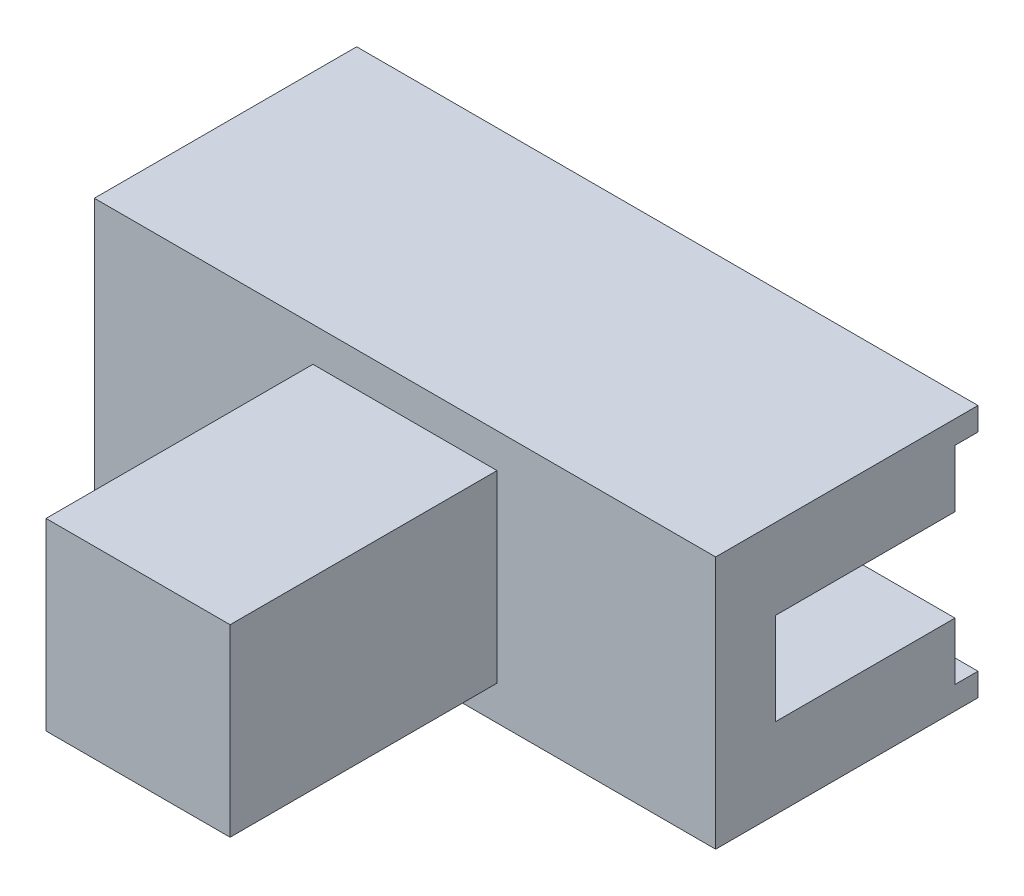
ISO-10303-21;
HEADER;
FILE_DESCRIPTION(('STEP AP214'),'2;1');
FILE_NAME('part.step','',(''),(''),'','','');
FILE_SCHEMA(('AUTOMOTIVE_DESIGN { 1 0 10303 214 1 1 1 1 }'));
ENDSEC;
DATA;
#1=APPLICATION_CONTEXT('core data for automotive mechanical design processes');
#2=APPLICATION_PROTOCOL_DEFINITION('international standard','automotive_design',2000,#1);
#3=PRODUCT_CONTEXT('',#1,'mechanical');
#4=PRODUCT('Part','Part','',(#3));
#5=PRODUCT_RELATED_PRODUCT_CATEGORY('part','',(#4));
#6=PRODUCT_DEFINITION_FORMATION('','',#4);
#7=PRODUCT_DEFINITION_CONTEXT('part definition',#1,'design');
#8=PRODUCT_DEFINITION('design','',#6,#7);
#9=PRODUCT_DEFINITION_SHAPE('','',#8);
#10=(LENGTH_UNIT() NAMED_UNIT(*) SI_UNIT(.MILLI.,.METRE.));
#11=(NAMED_UNIT(*) PLANE_ANGLE_UNIT() SI_UNIT($,.RADIAN.));
#12=(NAMED_UNIT(*) SI_UNIT($,.STERADIAN.) SOLID_ANGLE_UNIT());
#13=UNCERTAINTY_MEASURE_WITH_UNIT(LENGTH_MEASURE(1.E-05),#10,'distance_accuracy_value','');
#14=(GEOMETRIC_REPRESENTATION_CONTEXT(3) GLOBAL_UNCERTAINTY_ASSIGNED_CONTEXT((#13)) GLOBAL_UNIT_ASSIGNED_CONTEXT((#10,
#11,#12)) REPRESENTATION_CONTEXT('',''));
#15=CARTESIAN_POINT('',(0.,0.,0.));
#16=DIRECTION('',(0.,0.,1.));
#17=DIRECTION('',(1.,0.,0.));
#18=AXIS2_PLACEMENT_3D('',#15,#16,#17);
#19=CARTESIAN_POINT('',(2.125,-1.125,-2.85));
#20=DIRECTION('',(0.,-1.,0.));
#21=DIRECTION('',(0.,0.,-1.));
#22=AXIS2_PLACEMENT_3D('',#19,#20,#21);
#23=PLANE('',#22);
#24=DIRECTION('',(1.,0.,0.));
#25=VECTOR('',#24,1.);
#26=CARTESIAN_POINT('',(0.,-1.125,-0.650000000000002));
#27=LINE('',#26,#25);
#28=CARTESIAN_POINT('',(-2.125,-1.125,-0.650000000000002));
#29=VERTEX_POINT('',#28);
#30=CARTESIAN_POINT('',(2.125,-1.125,-0.650000000000002));
#31=VERTEX_POINT('',#30);
#32=EDGE_CURVE('E229',#29,#31,#27,.T.);
#33=ORIENTED_EDGE('',*,*,#32,.T.);
#34=DIRECTION('',(0.,0.,-1.));
#35=VECTOR('',#34,1.);
#36=CARTESIAN_POINT('',(2.125,-1.125,-2.85));
#37=LINE('',#36,#35);
#38=CARTESIAN_POINT('',(2.125,-1.125,-2.6));
#39=VERTEX_POINT('',#38);
#40=EDGE_CURVE('E248',#31,#39,#37,.T.);
#41=ORIENTED_EDGE('',*,*,#40,.T.);
#42=DIRECTION('',(1.,0.,0.));
#43=VECTOR('',#42,1.);
#44=CARTESIAN_POINT('',(2.125,-1.125,-2.6));
#45=LINE('',#44,#43);
#46=CARTESIAN_POINT('',(3.375,-1.125,-2.6));
#47=VERTEX_POINT('',#46);
#48=EDGE_CURVE('E209',#47,#39,#45,.F.);
#49=ORIENTED_EDGE('',*,*,#48,.F.);
#50=DIRECTION('',(0.,0.,-1.));
#51=VECTOR('',#50,1.);
#52=CARTESIAN_POINT('',(3.375,-1.125,-2.85));
#53=LINE('',#52,#51);
#54=CARTESIAN_POINT('',(3.375,-1.125,-2.85));
#55=VERTEX_POINT('',#54);
#56=EDGE_CURVE('E175',#55,#47,#53,.F.);
#57=ORIENTED_EDGE('',*,*,#56,.F.);
#58=DIRECTION('',(1.,0.,0.));
#59=VECTOR('',#58,1.);
#60=CARTESIAN_POINT('',(0.,-1.125,-2.85));
#61=LINE('',#60,#59);
#62=CARTESIAN_POINT('',(-3.375,-1.125,-2.85));
#63=VERTEX_POINT('',#62);
#64=EDGE_CURVE('E202',#55,#63,#61,.F.);
#65=ORIENTED_EDGE('',*,*,#64,.T.);
#66=DIRECTION('',(0.,0.,-1.));
#67=VECTOR('',#66,1.);
#68=CARTESIAN_POINT('',(-3.375,-1.125,-2.85));
#69=LINE('',#68,#67);
#70=CARTESIAN_POINT('',(-3.375,-1.125,-2.6));
#71=VERTEX_POINT('',#70);
#72=EDGE_CURVE('E190',#71,#63,#69,.T.);
#73=ORIENTED_EDGE('',*,*,#72,.F.);
#74=DIRECTION('',(1.,0.,0.));
#75=VECTOR('',#74,1.);
#76=CARTESIAN_POINT('',(2.125,-1.125,-2.6));
#77=LINE('',#76,#75);
#78=CARTESIAN_POINT('',(-2.125,-1.125,-2.6));
#79=VERTEX_POINT('',#78);
#80=EDGE_CURVE('E19',#79,#71,#77,.F.);
#81=ORIENTED_EDGE('',*,*,#80,.F.);
#82=DIRECTION('',(0.,0.,1.));
#83=VECTOR('',#82,1.);
#84=CARTESIAN_POINT('',(-2.125,-1.125,-2.85));
#85=LINE('',#84,#83);
#86=EDGE_CURVE('E237',#79,#29,#85,.T.);
#87=ORIENTED_EDGE('',*,*,#86,.T.);
#88=EDGE_LOOP('',(#33,#41,#49,#57,#65,#73,#81,#87));
#89=FACE_BOUND('',#88,.T.);
#90=ADVANCED_FACE('F16',(#89),#23,.F.);
#91=CARTESIAN_POINT('',(0.,0.,-0.650000000000002));
#92=DIRECTION('',(0.,0.,1.));
#93=DIRECTION('',(1.,0.,0.));
#94=AXIS2_PLACEMENT_3D('',#91,#92,#93);
#95=PLANE('',#94);
#96=DIRECTION('',(0.,1.,0.));
#97=VECTOR('',#96,1.);
#98=CARTESIAN_POINT('',(2.125,-0.5,-0.650000000000002));
#99=LINE('',#98,#97);
#100=CARTESIAN_POINT('',(2.125,-0.5,-0.650000000000002));
#101=VERTEX_POINT('',#100);
#102=EDGE_CURVE('E244',#101,#31,#99,.F.);
#103=ORIENTED_EDGE('',*,*,#102,.T.);
#104=ORIENTED_EDGE('',*,*,#32,.F.);
#105=DIRECTION('',(0.,1.,0.));
#106=VECTOR('',#105,1.);
#107=CARTESIAN_POINT('',(-2.125,-1.125,-0.650000000000002));
#108=LINE('',#107,#106);
#109=CARTESIAN_POINT('',(-2.125,-0.5,-0.650000000000002));
#110=VERTEX_POINT('',#109);
#111=EDGE_CURVE('E240',#29,#110,#108,.T.);
#112=ORIENTED_EDGE('',*,*,#111,.T.);
#113=DIRECTION('',(1.,0.,0.));
#114=VECTOR('',#113,1.);
#115=CARTESIAN_POINT('',(0.,-0.5,-0.650000000000002));
#116=LINE('',#115,#114);
#117=CARTESIAN_POINT('',(-3.375,-0.5,-0.650000000000002));
#118=VERTEX_POINT('',#117);
#119=EDGE_CURVE('E226',#118,#110,#116,.T.);
#120=ORIENTED_EDGE('',*,*,#119,.F.);
#121=DIRECTION('',(0.,1.,0.));
#122=VECTOR('',#121,1.);
#123=CARTESIAN_POINT('',(-3.375,0.,-0.650000000000002));
#124=LINE('',#123,#122);
#125=CARTESIAN_POINT('',(-3.375,0.5,-0.650000000000002));
#126=VERTEX_POINT('',#125);
#127=EDGE_CURVE('E223',#126,#118,#124,.F.);
#128=ORIENTED_EDGE('',*,*,#127,.F.);
#129=DIRECTION('',(1.,0.,0.));
#130=VECTOR('',#129,1.);
#131=CARTESIAN_POINT('',(0.,0.5,-0.650000000000002));
#132=LINE('',#131,#130);
#133=CARTESIAN_POINT('',(-2.125,0.5,-0.650000000000002));
#134=VERTEX_POINT('',#133);
#135=EDGE_CURVE('E220',#134,#126,#132,.F.);
#136=ORIENTED_EDGE('',*,*,#135,.F.);
#137=DIRECTION('',(0.,1.,0.));
#138=VECTOR('',#137,1.);
#139=CARTESIAN_POINT('',(-2.125,0.5,-0.650000000000002));
#140=LINE('',#139,#138);
#141=CARTESIAN_POINT('',(-2.125,1.125,-0.650000000000002));
#142=VERTEX_POINT('',#141);
#143=EDGE_CURVE('E234',#134,#142,#140,.T.);
#144=ORIENTED_EDGE('',*,*,#143,.T.);
#145=DIRECTION('',(1.,0.,0.));
#146=VECTOR('',#145,1.);
#147=CARTESIAN_POINT('',(-2.125,1.125,-0.650000000000002));
#148=LINE('',#147,#146);
#149=CARTESIAN_POINT('',(2.125,1.125,-0.650000000000002));
#150=VERTEX_POINT('',#149);
#151=EDGE_CURVE('E277',#142,#150,#148,.T.);
#152=ORIENTED_EDGE('',*,*,#151,.T.);
#153=DIRECTION('',(0.,1.,0.));
#154=VECTOR('',#153,1.);
#155=CARTESIAN_POINT('',(2.125,1.125,-0.650000000000002));
#156=LINE('',#155,#154);
#157=CARTESIAN_POINT('',(2.125,0.5,-0.650000000000002));
#158=VERTEX_POINT('',#157);
#159=EDGE_CURVE('E252',#150,#158,#156,.F.);
#160=ORIENTED_EDGE('',*,*,#159,.T.);
#161=DIRECTION('',(1.,0.,0.));
#162=VECTOR('',#161,1.);
#163=CARTESIAN_POINT('',(0.,0.5,-0.650000000000002));
#164=LINE('',#163,#162);
#165=CARTESIAN_POINT('',(3.375,0.5,-0.650000000000002));
#166=VERTEX_POINT('',#165);
#167=EDGE_CURVE('E217',#166,#158,#164,.F.);
#168=ORIENTED_EDGE('',*,*,#167,.F.);
#169=DIRECTION('',(0.,1.,0.));
#170=VECTOR('',#169,1.);
#171=CARTESIAN_POINT('',(3.375,0.,-0.650000000000002));
#172=LINE('',#171,#170);
#173=CARTESIAN_POINT('',(3.375,-0.5,-0.650000000000002));
#174=VERTEX_POINT('',#173);
#175=EDGE_CURVE('E214',#174,#166,#172,.T.);
#176=ORIENTED_EDGE('',*,*,#175,.F.);
#177=DIRECTION('',(1.,0.,0.));
#178=VECTOR('',#177,1.);
#179=CARTESIAN_POINT('',(0.,-0.5,-0.650000000000002));
#180=LINE('',#179,#178);
#181=EDGE_CURVE('E232',#101,#174,#180,.T.);
#182=ORIENTED_EDGE('',*,*,#181,.F.);
#183=EDGE_LOOP('',(#103,#104,#112,#120,#128,#136,#144,#152,#160,#168,#176,#182));
#184=FACE_BOUND('',#183,.T.);
#185=ADVANCED_FACE('F471',(#184),#95,.F.);
#186=CARTESIAN_POINT('',(-2.125,0.5,-2.85));
#187=DIRECTION('',(-1.,0.,0.));
#188=DIRECTION('',(0.,0.,1.));
#189=AXIS2_PLACEMENT_3D('',#186,#187,#188);
#190=PLANE('',#189);
#191=DIRECTION('',(0.,0.,1.));
#192=VECTOR('',#191,1.);
#193=CARTESIAN_POINT('',(-2.125,1.125,-2.85));
#194=LINE('',#193,#192);
#195=CARTESIAN_POINT('',(-2.125,1.125,-2.6));
#196=VERTEX_POINT('',#195);
#197=EDGE_CURVE('E273',#196,#142,#194,.T.);
#198=ORIENTED_EDGE('',*,*,#197,.T.);
#199=ORIENTED_EDGE('',*,*,#143,.F.);
#200=DIRECTION('',(0.,0.,1.));
#201=VECTOR('',#200,1.);
#202=CARTESIAN_POINT('',(-2.125,0.5,-2.85));
#203=LINE('',#202,#201);
#204=CARTESIAN_POINT('',(-2.125,0.5,-2.6));
#205=VERTEX_POINT('',#204);
#206=EDGE_CURVE('E293',#134,#205,#203,.F.);
#207=ORIENTED_EDGE('',*,*,#206,.T.);
#208=DIRECTION('',(0.,1.,0.));
#209=VECTOR('',#208,1.);
#210=CARTESIAN_POINT('',(-2.125,-1.125,-2.6));
#211=LINE('',#210,#209);
#212=EDGE_CURVE('E286',#205,#196,#211,.T.);
#213=ORIENTED_EDGE('',*,*,#212,.T.);
#214=EDGE_LOOP('',(#198,#199,#207,#213));
#215=FACE_BOUND('',#214,.T.);
#216=ADVANCED_FACE('F757',(#215),#190,.F.);
#217=CARTESIAN_POINT('',(-2.125,-1.125,-2.85));
#218=DIRECTION('',(-1.,0.,0.));
#219=DIRECTION('',(0.,0.,1.));
#220=AXIS2_PLACEMENT_3D('',#217,#218,#219);
#221=PLANE('',#220);
#222=DIRECTION('',(0.,0.,-1.));
#223=VECTOR('',#222,1.);
#224=CARTESIAN_POINT('',(-2.125,-0.5,-2.85));
#225=LINE('',#224,#223);
#226=CARTESIAN_POINT('',(-2.125,-0.5,-2.6));
#227=VERTEX_POINT('',#226);
#228=EDGE_CURVE('E299',#227,#110,#225,.F.);
#229=ORIENTED_EDGE('',*,*,#228,.T.);
#230=ORIENTED_EDGE('',*,*,#111,.F.);
#231=ORIENTED_EDGE('',*,*,#86,.F.);
#232=DIRECTION('',(0.,1.,0.));
#233=VECTOR('',#232,1.);
#234=CARTESIAN_POINT('',(-2.125,-1.125,-2.6));
#235=LINE('',#234,#233);
#236=EDGE_CURVE('E185',#79,#227,#235,.T.);
#237=ORIENTED_EDGE('',*,*,#236,.T.);
#238=EDGE_LOOP('',(#229,#230,#231,#237));
#239=FACE_BOUND('',#238,.T.);
#240=ADVANCED_FACE('F479',(#239),#221,.F.);
#241=CARTESIAN_POINT('',(0.,0.,2.9));
#242=DIRECTION('',(0.,0.,1.));
#243=DIRECTION('',(1.,0.,0.));
#244=AXIS2_PLACEMENT_3D('',#241,#242,#243);
#245=PLANE('',#244);
#246=DIRECTION('',(0.,1.,0.));
#247=VECTOR('',#246,1.);
#248=CARTESIAN_POINT('',(-1.,-1.,2.9));
#249=LINE('',#248,#247);
#250=CARTESIAN_POINT('',(-1.,-1.,2.9));
#251=VERTEX_POINT('',#250);
#252=CARTESIAN_POINT('',(-1.,1.,2.9));
#253=VERTEX_POINT('',#252);
#254=EDGE_CURVE('E318',#251,#253,#249,.T.);
#255=ORIENTED_EDGE('',*,*,#254,.F.);
#256=DIRECTION('',(1.,0.,0.));
#257=VECTOR('',#256,1.);
#258=CARTESIAN_POINT('',(1.,-1.,2.9));
#259=LINE('',#258,#257);
#260=CARTESIAN_POINT('',(1.,-1.,2.9));
#261=VERTEX_POINT('',#260);
#262=EDGE_CURVE('E310',#261,#251,#259,.F.);
#263=ORIENTED_EDGE('',*,*,#262,.F.);
#264=DIRECTION('',(0.,1.,0.));
#265=VECTOR('',#264,1.);
#266=CARTESIAN_POINT('',(1.,1.,2.9));
#267=LINE('',#266,#265);
#268=CARTESIAN_POINT('',(1.,1.,2.9));
#269=VERTEX_POINT('',#268);
#270=EDGE_CURVE('E306',#269,#261,#267,.F.);
#271=ORIENTED_EDGE('',*,*,#270,.F.);
#272=DIRECTION('',(1.,0.,0.));
#273=VECTOR('',#272,1.);
#274=CARTESIAN_POINT('',(-1.,1.,2.9));
#275=LINE('',#274,#273);
#276=EDGE_CURVE('E326',#253,#269,#275,.T.);
#277=ORIENTED_EDGE('',*,*,#276,.F.);
#278=EDGE_LOOP('',(#255,#263,#271,#277));
#279=FACE_BOUND('',#278,.T.);
#280=ADVANCED_FACE('F517',(#279),#245,.T.);
#281=CARTESIAN_POINT('',(2.125,-0.5,-2.85));
#282=DIRECTION('',(1.,0.,0.));
#283=DIRECTION('',(0.,0.,-1.));
#284=AXIS2_PLACEMENT_3D('',#281,#282,#283);
#285=PLANE('',#284);
#286=ORIENTED_EDGE('',*,*,#40,.F.);
#287=ORIENTED_EDGE('',*,*,#102,.F.);
#288=DIRECTION('',(0.,0.,-1.));
#289=VECTOR('',#288,1.);
#290=CARTESIAN_POINT('',(2.125,-0.5,-2.85));
#291=LINE('',#290,#289);
#292=CARTESIAN_POINT('',(2.125,-0.5,-2.6));
#293=VERTEX_POINT('',#292);
#294=EDGE_CURVE('E342',#101,#293,#291,.T.);
#295=ORIENTED_EDGE('',*,*,#294,.T.);
#296=DIRECTION('',(0.,1.,0.));
#297=VECTOR('',#296,1.);
#298=CARTESIAN_POINT('',(2.125,-1.125,-2.6));
#299=LINE('',#298,#297);
#300=EDGE_CURVE('E338',#293,#39,#299,.F.);
#301=ORIENTED_EDGE('',*,*,#300,.T.);
#302=EDGE_LOOP('',(#286,#287,#295,#301));
#303=FACE_BOUND('',#302,.T.);
#304=ADVANCED_FACE('F485',(#303),#285,.F.);
#305=CARTESIAN_POINT('',(2.125,1.125,-2.85));
#306=DIRECTION('',(1.,0.,0.));
#307=DIRECTION('',(0.,0.,-1.));
#308=AXIS2_PLACEMENT_3D('',#305,#306,#307);
#309=PLANE('',#308);
#310=DIRECTION('',(0.,0.,1.));
#311=VECTOR('',#310,1.);
#312=CARTESIAN_POINT('',(2.125,0.5,-2.85));
#313=LINE('',#312,#311);
#314=CARTESIAN_POINT('',(2.125,0.5,-2.6));
#315=VERTEX_POINT('',#314);
#316=EDGE_CURVE('E347',#315,#158,#313,.T.);
#317=ORIENTED_EDGE('',*,*,#316,.T.);
#318=ORIENTED_EDGE('',*,*,#159,.F.);
#319=DIRECTION('',(0.,0.,1.));
#320=VECTOR('',#319,1.);
#321=CARTESIAN_POINT('',(2.125,1.125,-2.85));
#322=LINE('',#321,#320);
#323=CARTESIAN_POINT('',(2.125,1.125,-2.6));
#324=VERTEX_POINT('',#323);
#325=EDGE_CURVE('E280',#150,#324,#322,.F.);
#326=ORIENTED_EDGE('',*,*,#325,.T.);
#327=DIRECTION('',(0.,1.,0.));
#328=VECTOR('',#327,1.);
#329=CARTESIAN_POINT('',(2.125,1.125,-2.6));
#330=LINE('',#329,#328);
#331=EDGE_CURVE('E256',#315,#324,#330,.T.);
#332=ORIENTED_EDGE('',*,*,#331,.F.);
#333=EDGE_LOOP('',(#317,#318,#326,#332));
#334=FACE_BOUND('',#333,.T.);
#335=ADVANCED_FACE('F506',(#334),#309,.F.);
#336=CARTESIAN_POINT('',(0.,0.,-2.85));
#337=DIRECTION('',(0.,0.,1.));
#338=DIRECTION('',(1.,0.,0.));
#339=AXIS2_PLACEMENT_3D('',#336,#337,#338);
#340=PLANE('',#339);
#341=DIRECTION('',(0.,1.,0.));
#342=VECTOR('',#341,1.);
#343=CARTESIAN_POINT('',(3.375,0.,-2.85));
#344=LINE('',#343,#342);
#345=CARTESIAN_POINT('',(3.375,-1.375,-2.85));
#346=VERTEX_POINT('',#345);
#347=EDGE_CURVE('E262',#346,#55,#344,.T.);
#348=ORIENTED_EDGE('',*,*,#347,.F.);
#349=DIRECTION('',(1.,0.,0.));
#350=VECTOR('',#349,1.);
#351=CARTESIAN_POINT('',(-3.375,-1.375,-2.85));
#352=LINE('',#351,#350);
#353=CARTESIAN_POINT('',(-3.375,-1.375,-2.85));
#354=VERTEX_POINT('',#353);
#355=EDGE_CURVE('E358',#354,#346,#352,.T.);
#356=ORIENTED_EDGE('',*,*,#355,.F.);
#357=DIRECTION('',(0.,1.,0.));
#358=VECTOR('',#357,1.);
#359=CARTESIAN_POINT('',(-3.375,0.,-2.85));
#360=LINE('',#359,#358);
#361=EDGE_CURVE('E259',#63,#354,#360,.F.);
#362=ORIENTED_EDGE('',*,*,#361,.F.);
#363=ORIENTED_EDGE('',*,*,#64,.F.);
#364=EDGE_LOOP('',(#348,#356,#362,#363));
#365=FACE_BOUND('',#364,.T.);
#366=ADVANCED_FACE('F508',(#365),#340,.F.);
#367=CARTESIAN_POINT('',(-2.125,1.125,-2.85));
#368=DIRECTION('',(0.,1.,0.));
#369=DIRECTION('',(0.,0.,1.));
#370=AXIS2_PLACEMENT_3D('',#367,#368,#369);
#371=PLANE('',#370);
#372=ORIENTED_EDGE('',*,*,#151,.F.);
#373=ORIENTED_EDGE('',*,*,#197,.F.);
#374=DIRECTION('',(1.,0.,0.));
#375=VECTOR('',#374,1.);
#376=CARTESIAN_POINT('',(0.,1.125,-2.6));
#377=LINE('',#376,#375);
#378=CARTESIAN_POINT('',(-3.375,1.125,-2.6));
#379=VERTEX_POINT('',#378);
#380=EDGE_CURVE('E289',#196,#379,#377,.F.);
#381=ORIENTED_EDGE('',*,*,#380,.T.);
#382=DIRECTION('',(0.,0.,1.));
#383=VECTOR('',#382,1.);
#384=CARTESIAN_POINT('',(-3.375,1.125,-2.85));
#385=LINE('',#384,#383);
#386=CARTESIAN_POINT('',(-3.375,1.125,-2.85));
#387=VERTEX_POINT('',#386);
#388=EDGE_CURVE('E270',#387,#379,#385,.T.);
#389=ORIENTED_EDGE('',*,*,#388,.F.);
#390=DIRECTION('',(1.,0.,0.));
#391=VECTOR('',#390,1.);
#392=CARTESIAN_POINT('',(0.,1.125,-2.85));
#393=LINE('',#392,#391);
#394=CARTESIAN_POINT('',(3.375,1.125,-2.85));
#395=VERTEX_POINT('',#394);
#396=EDGE_CURVE('E199',#387,#395,#393,.T.);
#397=ORIENTED_EDGE('',*,*,#396,.T.);
#398=DIRECTION('',(0.,0.,1.));
#399=VECTOR('',#398,1.);
#400=CARTESIAN_POINT('',(3.375,1.125,-2.85));
#401=LINE('',#400,#399);
#402=CARTESIAN_POINT('',(3.375,1.125,-2.6));
#403=VERTEX_POINT('',#402);
#404=EDGE_CURVE('E267',#403,#395,#401,.F.);
#405=ORIENTED_EDGE('',*,*,#404,.F.);
#406=DIRECTION('',(1.,0.,0.));
#407=VECTOR('',#406,1.);
#408=CARTESIAN_POINT('',(0.,1.125,-2.6));
#409=LINE('',#408,#407);
#410=EDGE_CURVE('E351',#403,#324,#409,.F.);
#411=ORIENTED_EDGE('',*,*,#410,.T.);
#412=ORIENTED_EDGE('',*,*,#325,.F.);
#413=EDGE_LOOP('',(#372,#373,#381,#389,#397,#405,#411,#412));
#414=FACE_BOUND('',#413,.T.);
#415=ADVANCED_FACE('F459',(#414),#371,.F.);
#416=CARTESIAN_POINT('',(0.,-1.125,-2.6));
#417=DIRECTION('',(0.,0.,1.));
#418=DIRECTION('',(1.,0.,0.));
#419=AXIS2_PLACEMENT_3D('',#416,#417,#418);
#420=PLANE('',#419);
#421=DIRECTION('',(1.,0.,0.));
#422=VECTOR('',#421,1.);
#423=CARTESIAN_POINT('',(-2.125,-0.5,-2.6));
#424=LINE('',#423,#422);
#425=CARTESIAN_POINT('',(-3.375,-0.5,-2.6));
#426=VERTEX_POINT('',#425);
#427=EDGE_CURVE('E303',#426,#227,#424,.T.);
#428=ORIENTED_EDGE('',*,*,#427,.T.);
#429=ORIENTED_EDGE('',*,*,#236,.F.);
#430=ORIENTED_EDGE('',*,*,#80,.T.);
#431=DIRECTION('',(0.,1.,0.));
#432=VECTOR('',#431,1.);
#433=CARTESIAN_POINT('',(-3.375,1.375,-2.6));
#434=LINE('',#433,#432);
#435=EDGE_CURVE('E183',#426,#71,#434,.F.);
#436=ORIENTED_EDGE('',*,*,#435,.F.);
#437=EDGE_LOOP('',(#428,#429,#430,#436));
#438=FACE_BOUND('',#437,.T.);
#439=ADVANCED_FACE('F182',(#438),#420,.F.);
#440=CARTESIAN_POINT('',(0.,-1.125,-2.6));
#441=DIRECTION('',(0.,0.,1.));
#442=DIRECTION('',(1.,0.,0.));
#443=AXIS2_PLACEMENT_3D('',#440,#441,#442);
#444=PLANE('',#443);
#445=ORIENTED_EDGE('',*,*,#380,.F.);
#446=ORIENTED_EDGE('',*,*,#212,.F.);
#447=DIRECTION('',(1.,0.,0.));
#448=VECTOR('',#447,1.);
#449=CARTESIAN_POINT('',(-3.375,0.5,-2.6));
#450=LINE('',#449,#448);
#451=CARTESIAN_POINT('',(-3.375,0.5,-2.6));
#452=VERTEX_POINT('',#451);
#453=EDGE_CURVE('E296',#205,#452,#450,.F.);
#454=ORIENTED_EDGE('',*,*,#453,.T.);
#455=DIRECTION('',(0.,1.,0.));
#456=VECTOR('',#455,1.);
#457=CARTESIAN_POINT('',(-3.375,1.375,-2.6));
#458=LINE('',#457,#456);
#459=EDGE_CURVE('E372',#379,#452,#458,.F.);
#460=ORIENTED_EDGE('',*,*,#459,.F.);
#461=EDGE_LOOP('',(#445,#446,#454,#460));
#462=FACE_BOUND('',#461,.T.);
#463=ADVANCED_FACE('F462',(#462),#444,.F.);
#464=CARTESIAN_POINT('',(-3.375,0.5,-2.85));
#465=DIRECTION('',(0.,1.,0.));
#466=DIRECTION('',(0.,0.,1.));
#467=AXIS2_PLACEMENT_3D('',#464,#465,#466);
#468=PLANE('',#467);
#469=ORIENTED_EDGE('',*,*,#206,.F.);
#470=ORIENTED_EDGE('',*,*,#135,.T.);
#471=DIRECTION('',(0.,0.,1.));
#472=VECTOR('',#471,1.);
#473=CARTESIAN_POINT('',(-3.375,0.5,0.));
#474=LINE('',#473,#472);
#475=EDGE_CURVE('E376',#452,#126,#474,.T.);
#476=ORIENTED_EDGE('',*,*,#475,.F.);
#477=ORIENTED_EDGE('',*,*,#453,.F.);
#478=EDGE_LOOP('',(#469,#470,#476,#477));
#479=FACE_BOUND('',#478,.T.);
#480=ADVANCED_FACE('F467',(#479),#468,.F.);
#481=CARTESIAN_POINT('',(-2.125,-0.5,-2.85));
#482=DIRECTION('',(0.,-1.,0.));
#483=DIRECTION('',(0.,0.,-1.));
#484=AXIS2_PLACEMENT_3D('',#481,#482,#483);
#485=PLANE('',#484);
#486=DIRECTION('',(0.,0.,1.));
#487=VECTOR('',#486,1.);
#488=CARTESIAN_POINT('',(-3.375,-0.5,0.));
#489=LINE('',#488,#487);
#490=EDGE_CURVE('E196',#118,#426,#489,.F.);
#491=ORIENTED_EDGE('',*,*,#490,.F.);
#492=ORIENTED_EDGE('',*,*,#119,.T.);
#493=ORIENTED_EDGE('',*,*,#228,.F.);
#494=ORIENTED_EDGE('',*,*,#427,.F.);
#495=EDGE_LOOP('',(#491,#492,#493,#494));
#496=FACE_BOUND('',#495,.T.);
#497=ADVANCED_FACE('F477',(#496),#485,.F.);
#498=CARTESIAN_POINT('',(1.,1.,0.));
#499=DIRECTION('',(1.,0.,0.));
#500=DIRECTION('',(0.,0.,-1.));
#501=AXIS2_PLACEMENT_3D('',#498,#499,#500);
#502=PLANE('',#501);
#503=DIRECTION('',(0.,1.,0.));
#504=VECTOR('',#503,1.);
#505=CARTESIAN_POINT('',(1.,0.,0.));
#506=LINE('',#505,#504);
#507=CARTESIAN_POINT('',(1.,1.,0.));
#508=VERTEX_POINT('',#507);
#509=CARTESIAN_POINT('',(1.,-1.,0.));
#510=VERTEX_POINT('',#509);
#511=EDGE_CURVE('E389',#508,#510,#506,.F.);
#512=ORIENTED_EDGE('',*,*,#511,.F.);
#513=DIRECTION('',(0.,0.,1.));
#514=VECTOR('',#513,1.);
#515=CARTESIAN_POINT('',(1.,1.,0.));
#516=LINE('',#515,#514);
#517=EDGE_CURVE('E330',#269,#508,#516,.F.);
#518=ORIENTED_EDGE('',*,*,#517,.F.);
#519=ORIENTED_EDGE('',*,*,#270,.T.);
#520=DIRECTION('',(0.,0.,-1.));
#521=VECTOR('',#520,1.);
#522=CARTESIAN_POINT('',(1.,-1.,0.));
#523=LINE('',#522,#521);
#524=EDGE_CURVE('E314',#510,#261,#523,.F.);
#525=ORIENTED_EDGE('',*,*,#524,.F.);
#526=EDGE_LOOP('',(#512,#518,#519,#525));
#527=FACE_BOUND('',#526,.T.);
#528=ADVANCED_FACE('F555',(#527),#502,.T.);
#529=CARTESIAN_POINT('',(1.,-1.,0.));
#530=DIRECTION('',(0.,-1.,0.));
#531=DIRECTION('',(0.,0.,-1.));
#532=AXIS2_PLACEMENT_3D('',#529,#530,#531);
#533=PLANE('',#532);
#534=DIRECTION('',(1.,0.,0.));
#535=VECTOR('',#534,1.);
#536=CARTESIAN_POINT('',(0.,-1.,0.));
#537=LINE('',#536,#535);
#538=CARTESIAN_POINT('',(-1.,-1.,0.));
#539=VERTEX_POINT('',#538);
#540=EDGE_CURVE('E393',#510,#539,#537,.F.);
#541=ORIENTED_EDGE('',*,*,#540,.F.);
#542=ORIENTED_EDGE('',*,*,#524,.T.);
#543=ORIENTED_EDGE('',*,*,#262,.T.);
#544=DIRECTION('',(0.,0.,1.));
#545=VECTOR('',#544,1.);
#546=CARTESIAN_POINT('',(-1.,-1.,0.));
#547=LINE('',#546,#545);
#548=EDGE_CURVE('E322',#539,#251,#547,.T.);
#549=ORIENTED_EDGE('',*,*,#548,.F.);
#550=EDGE_LOOP('',(#541,#542,#543,#549));
#551=FACE_BOUND('',#550,.T.);
#552=ADVANCED_FACE('F551',(#551),#533,.T.);
#553=CARTESIAN_POINT('',(-1.,-1.,0.));
#554=DIRECTION('',(-1.,0.,0.));
#555=DIRECTION('',(0.,0.,1.));
#556=AXIS2_PLACEMENT_3D('',#553,#554,#555);
#557=PLANE('',#556);
#558=DIRECTION('',(0.,1.,0.));
#559=VECTOR('',#558,1.);
#560=CARTESIAN_POINT('',(-1.,0.,0.));
#561=LINE('',#560,#559);
#562=CARTESIAN_POINT('',(-1.,1.,0.));
#563=VERTEX_POINT('',#562);
#564=EDGE_CURVE('E397',#539,#563,#561,.T.);
#565=ORIENTED_EDGE('',*,*,#564,.F.);
#566=ORIENTED_EDGE('',*,*,#548,.T.);
#567=ORIENTED_EDGE('',*,*,#254,.T.);
#568=DIRECTION('',(0.,0.,1.));
#569=VECTOR('',#568,1.);
#570=CARTESIAN_POINT('',(-1.,1.,0.));
#571=LINE('',#570,#569);
#572=EDGE_CURVE('E334',#563,#253,#571,.T.);
#573=ORIENTED_EDGE('',*,*,#572,.F.);
#574=EDGE_LOOP('',(#565,#566,#567,#573));
#575=FACE_BOUND('',#574,.T.);
#576=ADVANCED_FACE('F547',(#575),#557,.T.);
#577=CARTESIAN_POINT('',(-1.,1.,0.));
#578=DIRECTION('',(0.,1.,0.));
#579=DIRECTION('',(0.,0.,1.));
#580=AXIS2_PLACEMENT_3D('',#577,#578,#579);
#581=PLANE('',#580);
#582=DIRECTION('',(1.,0.,0.));
#583=VECTOR('',#582,1.);
#584=CARTESIAN_POINT('',(0.,1.,0.));
#585=LINE('',#584,#583);
#586=EDGE_CURVE('E401',#563,#508,#585,.T.);
#587=ORIENTED_EDGE('',*,*,#586,.F.);
#588=ORIENTED_EDGE('',*,*,#572,.T.);
#589=ORIENTED_EDGE('',*,*,#276,.T.);
#590=ORIENTED_EDGE('',*,*,#517,.T.);
#591=EDGE_LOOP('',(#587,#588,#589,#590));
#592=FACE_BOUND('',#591,.T.);
#593=ADVANCED_FACE('F544',(#592),#581,.T.);
#594=CARTESIAN_POINT('',(0.,-1.125,-2.6));
#595=DIRECTION('',(0.,0.,1.));
#596=DIRECTION('',(1.,0.,0.));
#597=AXIS2_PLACEMENT_3D('',#594,#595,#596);
#598=PLANE('',#597);
#599=ORIENTED_EDGE('',*,*,#48,.T.);
#600=ORIENTED_EDGE('',*,*,#300,.F.);
#601=DIRECTION('',(1.,0.,0.));
#602=VECTOR('',#601,1.);
#603=CARTESIAN_POINT('',(3.375,-0.5,-2.6));
#604=LINE('',#603,#602);
#605=CARTESIAN_POINT('',(3.375,-0.5,-2.6));
#606=VERTEX_POINT('',#605);
#607=EDGE_CURVE('E345',#293,#606,#604,.T.);
#608=ORIENTED_EDGE('',*,*,#607,.T.);
#609=DIRECTION('',(0.,1.,0.));
#610=VECTOR('',#609,1.);
#611=CARTESIAN_POINT('',(3.375,-1.375,-2.6));
#612=LINE('',#611,#610);
#613=EDGE_CURVE('E405',#47,#606,#612,.T.);
#614=ORIENTED_EDGE('',*,*,#613,.F.);
#615=EDGE_LOOP('',(#599,#600,#608,#614));
#616=FACE_BOUND('',#615,.T.);
#617=ADVANCED_FACE('F489',(#616),#598,.F.);
#618=CARTESIAN_POINT('',(3.375,-0.5,-2.85));
#619=DIRECTION('',(0.,-1.,0.));
#620=DIRECTION('',(0.,0.,-1.));
#621=AXIS2_PLACEMENT_3D('',#618,#619,#620);
#622=PLANE('',#621);
#623=ORIENTED_EDGE('',*,*,#294,.F.);
#624=ORIENTED_EDGE('',*,*,#181,.T.);
#625=DIRECTION('',(0.,0.,-1.));
#626=VECTOR('',#625,1.);
#627=CARTESIAN_POINT('',(3.375,-0.5,0.));
#628=LINE('',#627,#626);
#629=EDGE_CURVE('E408',#606,#174,#628,.F.);
#630=ORIENTED_EDGE('',*,*,#629,.F.);
#631=ORIENTED_EDGE('',*,*,#607,.F.);
#632=EDGE_LOOP('',(#623,#624,#630,#631));
#633=FACE_BOUND('',#632,.T.);
#634=ADVANCED_FACE('F539',(#633),#622,.F.);
#635=CARTESIAN_POINT('',(2.125,0.5,-2.85));
#636=DIRECTION('',(0.,1.,0.));
#637=DIRECTION('',(0.,0.,1.));
#638=AXIS2_PLACEMENT_3D('',#635,#636,#637);
#639=PLANE('',#638);
#640=DIRECTION('',(0.,0.,-1.));
#641=VECTOR('',#640,1.);
#642=CARTESIAN_POINT('',(3.375,0.5,0.));
#643=LINE('',#642,#641);
#644=CARTESIAN_POINT('',(3.375,0.5,-2.6));
#645=VERTEX_POINT('',#644);
#646=EDGE_CURVE('E412',#166,#645,#643,.T.);
#647=ORIENTED_EDGE('',*,*,#646,.F.);
#648=ORIENTED_EDGE('',*,*,#167,.T.);
#649=ORIENTED_EDGE('',*,*,#316,.F.);
#650=DIRECTION('',(1.,0.,0.));
#651=VECTOR('',#650,1.);
#652=CARTESIAN_POINT('',(0.,0.5,-2.6));
#653=LINE('',#652,#651);
#654=EDGE_CURVE('E355',#315,#645,#653,.T.);
#655=ORIENTED_EDGE('',*,*,#654,.T.);
#656=EDGE_LOOP('',(#647,#648,#649,#655));
#657=FACE_BOUND('',#656,.T.);
#658=ADVANCED_FACE('F498',(#657),#639,.F.);
#659=CARTESIAN_POINT('',(0.,-1.125,-2.6));
#660=DIRECTION('',(0.,0.,1.));
#661=DIRECTION('',(1.,0.,0.));
#662=AXIS2_PLACEMENT_3D('',#659,#660,#661);
#663=PLANE('',#662);
#664=ORIENTED_EDGE('',*,*,#654,.F.);
#665=ORIENTED_EDGE('',*,*,#331,.T.);
#666=ORIENTED_EDGE('',*,*,#410,.F.);
#667=DIRECTION('',(0.,1.,0.));
#668=VECTOR('',#667,1.);
#669=CARTESIAN_POINT('',(3.375,-1.375,-2.6));
#670=LINE('',#669,#668);
#671=EDGE_CURVE('E416',#645,#403,#670,.T.);
#672=ORIENTED_EDGE('',*,*,#671,.F.);
#673=EDGE_LOOP('',(#664,#665,#666,#672));
#674=FACE_BOUND('',#673,.T.);
#675=ADVANCED_FACE('F503',(#674),#663,.F.);
#676=CARTESIAN_POINT('',(-3.375,-1.375,0.));
#677=DIRECTION('',(0.,-1.,0.));
#678=DIRECTION('',(0.,0.,-1.));
#679=AXIS2_PLACEMENT_3D('',#676,#677,#678);
#680=PLANE('',#679);
#681=DIRECTION('',(1.,0.,0.));
#682=VECTOR('',#681,1.);
#683=CARTESIAN_POINT('',(0.,-1.375,0.));
#684=LINE('',#683,#682);
#685=CARTESIAN_POINT('',(-3.375,-1.375,0.));
#686=VERTEX_POINT('',#685);
#687=CARTESIAN_POINT('',(3.375,-1.375,0.));
#688=VERTEX_POINT('',#687);
#689=EDGE_CURVE('E382',#686,#688,#684,.T.);
#690=ORIENTED_EDGE('',*,*,#689,.F.);
#691=DIRECTION('',(0.,0.,1.));
#692=VECTOR('',#691,1.);
#693=CARTESIAN_POINT('',(-3.375,-1.375,0.));
#694=LINE('',#693,#692);
#695=EDGE_CURVE('E198',#354,#686,#694,.T.);
#696=ORIENTED_EDGE('',*,*,#695,.F.);
#697=ORIENTED_EDGE('',*,*,#355,.T.);
#698=DIRECTION('',(0.,0.,-1.));
#699=VECTOR('',#698,1.);
#700=CARTESIAN_POINT('',(3.375,-1.375,0.));
#701=LINE('',#700,#699);
#702=EDGE_CURVE('E426',#688,#346,#701,.T.);
#703=ORIENTED_EDGE('',*,*,#702,.F.);
#704=EDGE_LOOP('',(#690,#696,#697,#703));
#705=FACE_BOUND('',#704,.T.);
#706=ADVANCED_FACE('F448',(#705),#680,.T.);
#707=CARTESIAN_POINT('',(0.,0.,-2.85));
#708=DIRECTION('',(0.,0.,1.));
#709=DIRECTION('',(1.,0.,0.));
#710=AXIS2_PLACEMENT_3D('',#707,#708,#709);
#711=PLANE('',#710);
#712=DIRECTION('',(0.,1.,0.));
#713=VECTOR('',#712,1.);
#714=CARTESIAN_POINT('',(-3.375,1.375,-2.85));
#715=LINE('',#714,#713);
#716=CARTESIAN_POINT('',(-3.375,1.375,-2.85));
#717=VERTEX_POINT('',#716);
#718=EDGE_CURVE('E368',#717,#387,#715,.F.);
#719=ORIENTED_EDGE('',*,*,#718,.F.);
#720=DIRECTION('',(1.,0.,0.));
#721=VECTOR('',#720,1.);
#722=CARTESIAN_POINT('',(3.375,1.375,-2.85));
#723=LINE('',#722,#721);
#724=CARTESIAN_POINT('',(3.375,1.375,-2.85));
#725=VERTEX_POINT('',#724);
#726=EDGE_CURVE('E430',#725,#717,#723,.F.);
#727=ORIENTED_EDGE('',*,*,#726,.F.);
#728=DIRECTION('',(0.,1.,0.));
#729=VECTOR('',#728,1.);
#730=CARTESIAN_POINT('',(3.375,-1.375,-2.85));
#731=LINE('',#730,#729);
#732=EDGE_CURVE('E420',#395,#725,#731,.T.);
#733=ORIENTED_EDGE('',*,*,#732,.F.);
#734=ORIENTED_EDGE('',*,*,#396,.F.);
#735=EDGE_LOOP('',(#719,#727,#733,#734));
#736=FACE_BOUND('',#735,.T.);
#737=ADVANCED_FACE('F453',(#736),#711,.F.);
#738=CARTESIAN_POINT('',(-3.375,1.375,0.));
#739=DIRECTION('',(-1.,0.,0.));
#740=DIRECTION('',(0.,0.,1.));
#741=AXIS2_PLACEMENT_3D('',#738,#739,#740);
#742=PLANE('',#741);
#743=ORIENTED_EDGE('',*,*,#127,.T.);
#744=ORIENTED_EDGE('',*,*,#490,.T.);
#745=ORIENTED_EDGE('',*,*,#435,.T.);
#746=ORIENTED_EDGE('',*,*,#72,.T.);
#747=ORIENTED_EDGE('',*,*,#361,.T.);
#748=ORIENTED_EDGE('',*,*,#695,.T.);
#749=DIRECTION('',(0.,1.,0.));
#750=VECTOR('',#749,1.);
#751=CARTESIAN_POINT('',(-3.375,0.,0.));
#752=LINE('',#751,#750);
#753=CARTESIAN_POINT('',(-3.375,1.375,0.));
#754=VERTEX_POINT('',#753);
#755=EDGE_CURVE('E385',#754,#686,#752,.F.);
#756=ORIENTED_EDGE('',*,*,#755,.F.);
#757=DIRECTION('',(0.,0.,1.));
#758=VECTOR('',#757,1.);
#759=CARTESIAN_POINT('',(-3.375,1.375,0.));
#760=LINE('',#759,#758);
#761=EDGE_CURVE('E434',#717,#754,#760,.T.);
#762=ORIENTED_EDGE('',*,*,#761,.F.);
#763=ORIENTED_EDGE('',*,*,#718,.T.);
#764=ORIENTED_EDGE('',*,*,#388,.T.);
#765=ORIENTED_EDGE('',*,*,#459,.T.);
#766=ORIENTED_EDGE('',*,*,#475,.T.);
#767=EDGE_LOOP('',(#743,#744,#745,#746,#747,#748,#756,#762,#763,#764,#765,#766));
#768=FACE_BOUND('',#767,.T.);
#769=ADVANCED_FACE('F193',(#768),#742,.T.);
#770=CARTESIAN_POINT('',(0.,0.,0.));
#771=DIRECTION('',(0.,0.,1.));
#772=DIRECTION('',(1.,0.,0.));
#773=AXIS2_PLACEMENT_3D('',#770,#771,#772);
#774=PLANE('',#773);
#775=ORIENTED_EDGE('',*,*,#564,.T.);
#776=ORIENTED_EDGE('',*,*,#586,.T.);
#777=ORIENTED_EDGE('',*,*,#511,.T.);
#778=ORIENTED_EDGE('',*,*,#540,.T.);
#779=EDGE_LOOP('',(#775,#776,#777,#778));
#780=FACE_BOUND('',#779,.T.);
#781=DIRECTION('',(1.,0.,0.));
#782=VECTOR('',#781,1.);
#783=CARTESIAN_POINT('',(3.375,1.375,0.));
#784=LINE('',#783,#782);
#785=CARTESIAN_POINT('',(3.375,1.375,0.));
#786=VERTEX_POINT('',#785);
#787=EDGE_CURVE('E26',#754,#786,#784,.T.);
#788=ORIENTED_EDGE('',*,*,#787,.F.);
#789=ORIENTED_EDGE('',*,*,#755,.T.);
#790=ORIENTED_EDGE('',*,*,#689,.T.);
#791=DIRECTION('',(0.,1.,0.));
#792=VECTOR('',#791,1.);
#793=CARTESIAN_POINT('',(3.375,-1.375,0.));
#794=LINE('',#793,#792);
#795=EDGE_CURVE('E35',#786,#688,#794,.F.);
#796=ORIENTED_EDGE('',*,*,#795,.F.);
#797=EDGE_LOOP('',(#788,#789,#790,#796));
#798=FACE_BOUND('',#797,.T.);
#799=ADVANCED_FACE('F443',(#780,#798),#774,.T.);
#800=CARTESIAN_POINT('',(3.375,-1.375,0.));
#801=DIRECTION('',(1.,0.,0.));
#802=DIRECTION('',(0.,0.,-1.));
#803=AXIS2_PLACEMENT_3D('',#800,#801,#802);
#804=PLANE('',#803);
#805=ORIENTED_EDGE('',*,*,#347,.T.);
#806=ORIENTED_EDGE('',*,*,#56,.T.);
#807=ORIENTED_EDGE('',*,*,#613,.T.);
#808=ORIENTED_EDGE('',*,*,#629,.T.);
#809=ORIENTED_EDGE('',*,*,#175,.T.);
#810=ORIENTED_EDGE('',*,*,#646,.T.);
#811=ORIENTED_EDGE('',*,*,#671,.T.);
#812=ORIENTED_EDGE('',*,*,#404,.T.);
#813=ORIENTED_EDGE('',*,*,#732,.T.);
#814=DIRECTION('',(0.,0.,1.));
#815=VECTOR('',#814,1.);
#816=CARTESIAN_POINT('',(3.375,1.375,0.));
#817=LINE('',#816,#815);
#818=EDGE_CURVE('E11',#786,#725,#817,.F.);
#819=ORIENTED_EDGE('',*,*,#818,.F.);
#820=ORIENTED_EDGE('',*,*,#795,.T.);
#821=ORIENTED_EDGE('',*,*,#702,.T.);
#822=EDGE_LOOP('',(#805,#806,#807,#808,#809,#810,#811,#812,#813,#819,#820,#821));
#823=FACE_BOUND('',#822,.T.);
#824=ADVANCED_FACE('F449',(#823),#804,.T.);
#825=CARTESIAN_POINT('',(3.375,1.375,0.));
#826=DIRECTION('',(0.,1.,0.));
#827=DIRECTION('',(0.,0.,1.));
#828=AXIS2_PLACEMENT_3D('',#825,#826,#827);
#829=PLANE('',#828);
#830=ORIENTED_EDGE('',*,*,#787,.T.);
#831=ORIENTED_EDGE('',*,*,#818,.T.);
#832=ORIENTED_EDGE('',*,*,#726,.T.);
#833=ORIENTED_EDGE('',*,*,#761,.T.);
#834=EDGE_LOOP('',(#830,#831,#832,#833));
#835=FACE_BOUND('',#834,.T.);
#836=ADVANCED_FACE('F441',(#835),#829,.T.);
#837=CLOSED_SHELL('',(#90,#185,#216,#240,#280,#304,#335,#366,#415,#439,#463,#480,#497,#528,#552,
#576,#593,#617,#634,#658,#675,#706,#737,#769,#799,#824,#836));
#838=MANIFOLD_SOLID_BREP('B1',#837);
#839=ADVANCED_BREP_SHAPE_REPRESENTATION('',(#18,#838),#14);
#840=SHAPE_DEFINITION_REPRESENTATION(#9,#839);
ENDSEC;
END-ISO-10303-21;
